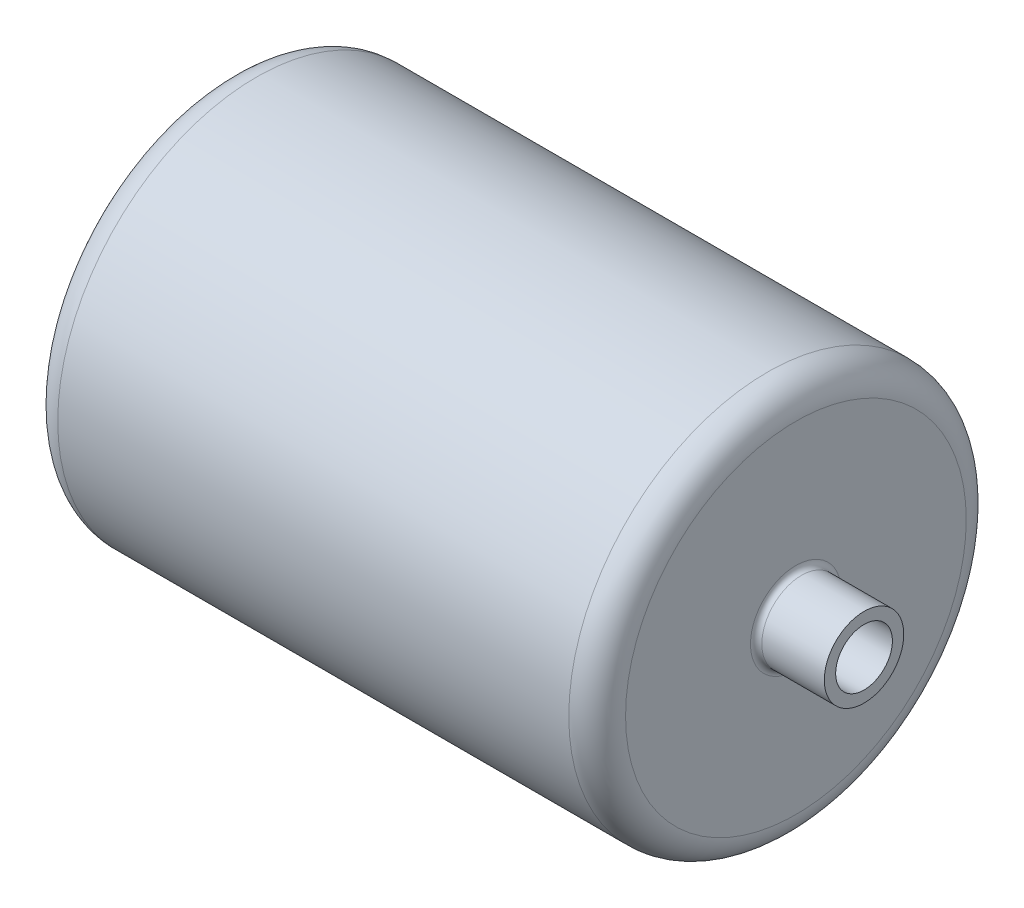
ISO-10303-21;
HEADER;
FILE_DESCRIPTION(('STEP AP214'),'2;1');
FILE_NAME('part.step','',(''),(''),'','','');
FILE_SCHEMA(('AUTOMOTIVE_DESIGN { 1 0 10303 214 1 1 1 1 }'));
ENDSEC;
DATA;
#1=APPLICATION_CONTEXT('core data for automotive mechanical design processes');
#2=APPLICATION_PROTOCOL_DEFINITION('international standard','automotive_design',2000,#1);
#3=PRODUCT_CONTEXT('',#1,'mechanical');
#4=PRODUCT('Part','Part','',(#3));
#5=PRODUCT_RELATED_PRODUCT_CATEGORY('part','',(#4));
#6=PRODUCT_DEFINITION_FORMATION('','',#4);
#7=PRODUCT_DEFINITION_CONTEXT('part definition',#1,'design');
#8=PRODUCT_DEFINITION('design','',#6,#7);
#9=PRODUCT_DEFINITION_SHAPE('','',#8);
#10=(LENGTH_UNIT() NAMED_UNIT(*) SI_UNIT(.MILLI.,.METRE.));
#11=(NAMED_UNIT(*) PLANE_ANGLE_UNIT() SI_UNIT($,.RADIAN.));
#12=(NAMED_UNIT(*) SI_UNIT($,.STERADIAN.) SOLID_ANGLE_UNIT());
#13=UNCERTAINTY_MEASURE_WITH_UNIT(LENGTH_MEASURE(1.E-05),#10,'distance_accuracy_value','');
#14=(GEOMETRIC_REPRESENTATION_CONTEXT(3) GLOBAL_UNCERTAINTY_ASSIGNED_CONTEXT((#13)) GLOBAL_UNIT_ASSIGNED_CONTEXT((#10,
#11,#12)) REPRESENTATION_CONTEXT('',''));
#15=CARTESIAN_POINT('',(0.,0.,0.));
#16=DIRECTION('',(0.,0.,1.));
#17=DIRECTION('',(1.,0.,0.));
#18=AXIS2_PLACEMENT_3D('',#15,#16,#17);
#19=CARTESIAN_POINT('',(-250.,150.,0.));
#20=DIRECTION('',(1.,0.,0.));
#21=DIRECTION('',(0.,0.,-1.));
#22=AXIS2_PLACEMENT_3D('',#19,#20,#21);
#23=PLANE('',#22);
#24=CARTESIAN_POINT('',(-250.,0.,0.));
#25=DIRECTION('',(-1.,0.,0.));
#26=DIRECTION('',(0.,0.,1.));
#27=AXIS2_PLACEMENT_3D('',#24,#25,#26);
#28=CIRCLE('',#27,150.);
#29=CARTESIAN_POINT('',(-250.,0.,150.));
#30=VERTEX_POINT('',#29);
#31=EDGE_CURVE('E41',#30,#30,#28,.T.);
#32=ORIENTED_EDGE('',*,*,#31,.T.);
#33=EDGE_LOOP('',(#32));
#34=FACE_BOUND('',#33,.T.);
#35=ADVANCED_FACE('F30',(#34),#23,.F.);
#36=CARTESIAN_POINT('',(-225.,0.,0.));
#37=DIRECTION('',(-1.,0.,0.));
#38=DIRECTION('',(0.,0.,1.));
#39=AXIS2_PLACEMENT_3D('',#36,#37,#38);
#40=TOROIDAL_SURFACE('',#39,150.,25.);
#41=ORIENTED_EDGE('',*,*,#31,.F.);
#42=EDGE_LOOP('',(#41));
#43=FACE_BOUND('',#42,.T.);
#44=CARTESIAN_POINT('',(-225.,0.,0.));
#45=DIRECTION('',(-1.,0.,0.));
#46=DIRECTION('',(0.,0.,1.));
#47=AXIS2_PLACEMENT_3D('',#44,#45,#46);
#48=CIRCLE('',#47,175.);
#49=CARTESIAN_POINT('',(-225.,0.,175.));
#50=VERTEX_POINT('',#49);
#51=EDGE_CURVE('E45',#50,#50,#48,.T.);
#52=ORIENTED_EDGE('',*,*,#51,.T.);
#53=EDGE_LOOP('',(#52));
#54=FACE_BOUND('',#53,.T.);
#55=ADVANCED_FACE('F92',(#43,#54),#40,.T.);
#56=CARTESIAN_POINT('',(-162.286662160442,0.,0.));
#57=DIRECTION('',(-1.,0.,0.));
#58=DIRECTION('',(0.,0.,1.));
#59=AXIS2_PLACEMENT_3D('',#56,#57,#58);
#60=CYLINDRICAL_SURFACE('',#59,175.);
#61=ORIENTED_EDGE('',*,*,#51,.F.);
#62=EDGE_LOOP('',(#61));
#63=FACE_BOUND('',#62,.T.);
#64=CARTESIAN_POINT('',(225.,0.,0.));
#65=DIRECTION('',(-1.,0.,0.));
#66=DIRECTION('',(0.,0.,1.));
#67=AXIS2_PLACEMENT_3D('',#64,#65,#66);
#68=CIRCLE('',#67,175.);
#69=CARTESIAN_POINT('',(225.,0.,175.));
#70=VERTEX_POINT('',#69);
#71=EDGE_CURVE('E50',#70,#70,#68,.T.);
#72=ORIENTED_EDGE('',*,*,#71,.T.);
#73=EDGE_LOOP('',(#72));
#74=FACE_BOUND('',#73,.T.);
#75=ADVANCED_FACE('F97',(#63,#74),#60,.T.);
#76=CARTESIAN_POINT('',(225.,0.,0.));
#77=DIRECTION('',(-1.,0.,0.));
#78=DIRECTION('',(0.,0.,1.));
#79=AXIS2_PLACEMENT_3D('',#76,#77,#78);
#80=TOROIDAL_SURFACE('',#79,150.,25.);
#81=ORIENTED_EDGE('',*,*,#71,.F.);
#82=EDGE_LOOP('',(#81));
#83=FACE_BOUND('',#82,.T.);
#84=CARTESIAN_POINT('',(250.,0.,0.));
#85=DIRECTION('',(-1.,0.,0.));
#86=DIRECTION('',(0.,0.,1.));
#87=AXIS2_PLACEMENT_3D('',#84,#85,#86);
#88=CIRCLE('',#87,150.);
#89=CARTESIAN_POINT('',(250.,0.,150.));
#90=VERTEX_POINT('',#89);
#91=EDGE_CURVE('E53',#90,#90,#88,.T.);
#92=ORIENTED_EDGE('',*,*,#91,.T.);
#93=EDGE_LOOP('',(#92));
#94=FACE_BOUND('',#93,.T.);
#95=ADVANCED_FACE('F103',(#83,#94),#80,.T.);
#96=CARTESIAN_POINT('',(250.,35.,0.));
#97=DIRECTION('',(-1.,0.,0.));
#98=DIRECTION('',(0.,0.,1.));
#99=AXIS2_PLACEMENT_3D('',#96,#97,#98);
#100=PLANE('',#99);
#101=CARTESIAN_POINT('',(250.,0.,0.));
#102=DIRECTION('',(-1.,0.,0.));
#103=DIRECTION('',(0.,0.,1.));
#104=AXIS2_PLACEMENT_3D('',#101,#102,#103);
#105=CIRCLE('',#104,40.);
#106=CARTESIAN_POINT('',(250.,0.,40.));
#107=VERTEX_POINT('',#106);
#108=EDGE_CURVE('E37',#107,#107,#105,.T.);
#109=ORIENTED_EDGE('',*,*,#108,.T.);
#110=EDGE_LOOP('',(#109));
#111=FACE_BOUND('',#110,.T.);
#112=ORIENTED_EDGE('',*,*,#91,.F.);
#113=EDGE_LOOP('',(#112));
#114=FACE_BOUND('',#113,.T.);
#115=ADVANCED_FACE('F107',(#111,#114),#100,.F.);
#116=CARTESIAN_POINT('',(-162.286662160442,0.,0.));
#117=DIRECTION('',(-1.,0.,0.));
#118=DIRECTION('',(0.,0.,1.));
#119=AXIS2_PLACEMENT_3D('',#116,#117,#118);
#120=CYLINDRICAL_SURFACE('',#119,35.);
#121=CARTESIAN_POINT('',(255.,0.,0.));
#122=DIRECTION('',(-1.,0.,0.));
#123=DIRECTION('',(0.,0.,1.));
#124=AXIS2_PLACEMENT_3D('',#121,#122,#123);
#125=CIRCLE('',#124,35.);
#126=CARTESIAN_POINT('',(255.,0.,35.));
#127=VERTEX_POINT('',#126);
#128=EDGE_CURVE('E10',#127,#127,#125,.F.);
#129=ORIENTED_EDGE('',*,*,#128,.T.);
#130=EDGE_LOOP('',(#129));
#131=FACE_BOUND('',#130,.T.);
#132=CARTESIAN_POINT('',(310.,0.,0.));
#133=DIRECTION('',(-1.,0.,0.));
#134=DIRECTION('',(0.,0.,1.));
#135=AXIS2_PLACEMENT_3D('',#132,#133,#134);
#136=CIRCLE('',#135,35.);
#137=CARTESIAN_POINT('',(310.,0.,35.));
#138=VERTEX_POINT('',#137);
#139=EDGE_CURVE('E56',#138,#138,#136,.T.);
#140=ORIENTED_EDGE('',*,*,#139,.T.);
#141=EDGE_LOOP('',(#140));
#142=FACE_BOUND('',#141,.T.);
#143=ADVANCED_FACE('F111',(#131,#142),#120,.T.);
#144=CARTESIAN_POINT('',(310.,25.,0.));
#145=DIRECTION('',(-1.,0.,0.));
#146=DIRECTION('',(0.,0.,1.));
#147=AXIS2_PLACEMENT_3D('',#144,#145,#146);
#148=PLANE('',#147);
#149=ORIENTED_EDGE('',*,*,#139,.F.);
#150=EDGE_LOOP('',(#149));
#151=FACE_BOUND('',#150,.T.);
#152=CARTESIAN_POINT('',(310.,0.,0.));
#153=DIRECTION('',(-1.,0.,0.));
#154=DIRECTION('',(0.,0.,1.));
#155=AXIS2_PLACEMENT_3D('',#152,#153,#154);
#156=CIRCLE('',#155,25.);
#157=CARTESIAN_POINT('',(310.,0.,25.));
#158=VERTEX_POINT('',#157);
#159=EDGE_CURVE('E59',#158,#158,#156,.T.);
#160=ORIENTED_EDGE('',*,*,#159,.T.);
#161=EDGE_LOOP('',(#160));
#162=FACE_BOUND('',#161,.T.);
#163=ADVANCED_FACE('F114',(#151,#162),#148,.F.);
#164=CARTESIAN_POINT('',(-162.286662160442,0.,0.));
#165=DIRECTION('',(-1.,0.,0.));
#166=DIRECTION('',(0.,0.,1.));
#167=AXIS2_PLACEMENT_3D('',#164,#165,#166);
#168=CYLINDRICAL_SURFACE('',#167,25.);
#169=ORIENTED_EDGE('',*,*,#159,.F.);
#170=EDGE_LOOP('',(#169));
#171=FACE_BOUND('',#170,.T.);
#172=CARTESIAN_POINT('',(225.,0.,0.));
#173=DIRECTION('',(-1.,0.,0.));
#174=DIRECTION('',(0.,0.,1.));
#175=AXIS2_PLACEMENT_3D('',#172,#173,#174);
#176=CIRCLE('',#175,25.);
#177=CARTESIAN_POINT('',(225.,0.,25.));
#178=VERTEX_POINT('',#177);
#179=EDGE_CURVE('E62',#178,#178,#176,.T.);
#180=ORIENTED_EDGE('',*,*,#179,.T.);
#181=EDGE_LOOP('',(#180));
#182=FACE_BOUND('',#181,.T.);
#183=ADVANCED_FACE('F117',(#171,#182),#168,.F.);
#184=CARTESIAN_POINT('',(225.,137.5,0.));
#185=DIRECTION('',(1.,0.,0.));
#186=DIRECTION('',(0.,0.,-1.));
#187=AXIS2_PLACEMENT_3D('',#184,#185,#186);
#188=PLANE('',#187);
#189=ORIENTED_EDGE('',*,*,#179,.F.);
#190=EDGE_LOOP('',(#189));
#191=FACE_BOUND('',#190,.T.);
#192=CARTESIAN_POINT('',(225.,0.,0.));
#193=DIRECTION('',(-1.,0.,0.));
#194=DIRECTION('',(0.,0.,1.));
#195=AXIS2_PLACEMENT_3D('',#192,#193,#194);
#196=CIRCLE('',#195,137.5);
#197=CARTESIAN_POINT('',(225.,0.,137.5));
#198=VERTEX_POINT('',#197);
#199=EDGE_CURVE('E65',#198,#198,#196,.T.);
#200=ORIENTED_EDGE('',*,*,#199,.T.);
#201=EDGE_LOOP('',(#200));
#202=FACE_BOUND('',#201,.T.);
#203=ADVANCED_FACE('F121',(#191,#202),#188,.F.);
#204=CARTESIAN_POINT('',(212.5,0.,0.));
#205=DIRECTION('',(-1.,0.,0.));
#206=DIRECTION('',(0.,0.,1.));
#207=AXIS2_PLACEMENT_3D('',#204,#205,#206);
#208=TOROIDAL_SURFACE('',#207,137.5,12.5);
#209=ORIENTED_EDGE('',*,*,#199,.F.);
#210=EDGE_LOOP('',(#209));
#211=FACE_BOUND('',#210,.T.);
#212=CARTESIAN_POINT('',(212.5,0.,0.));
#213=DIRECTION('',(-1.,0.,0.));
#214=DIRECTION('',(0.,0.,1.));
#215=AXIS2_PLACEMENT_3D('',#212,#213,#214);
#216=CIRCLE('',#215,150.);
#217=CARTESIAN_POINT('',(212.5,0.,150.));
#218=VERTEX_POINT('',#217);
#219=EDGE_CURVE('E68',#218,#218,#216,.T.);
#220=ORIENTED_EDGE('',*,*,#219,.T.);
#221=EDGE_LOOP('',(#220));
#222=FACE_BOUND('',#221,.T.);
#223=ADVANCED_FACE('F125',(#211,#222),#208,.F.);
#224=CARTESIAN_POINT('',(-162.286662160442,0.,0.));
#225=DIRECTION('',(-1.,0.,0.));
#226=DIRECTION('',(0.,0.,1.));
#227=AXIS2_PLACEMENT_3D('',#224,#225,#226);
#228=CYLINDRICAL_SURFACE('',#227,150.);
#229=ORIENTED_EDGE('',*,*,#219,.F.);
#230=EDGE_LOOP('',(#229));
#231=FACE_BOUND('',#230,.T.);
#232=CARTESIAN_POINT('',(-212.5,0.,0.));
#233=DIRECTION('',(-1.,0.,0.));
#234=DIRECTION('',(0.,0.,1.));
#235=AXIS2_PLACEMENT_3D('',#232,#233,#234);
#236=CIRCLE('',#235,150.);
#237=CARTESIAN_POINT('',(-212.5,0.,150.));
#238=VERTEX_POINT('',#237);
#239=EDGE_CURVE('E71',#238,#238,#236,.T.);
#240=ORIENTED_EDGE('',*,*,#239,.T.);
#241=EDGE_LOOP('',(#240));
#242=FACE_BOUND('',#241,.T.);
#243=ADVANCED_FACE('F88',(#231,#242),#228,.F.);
#244=CARTESIAN_POINT('',(-212.5,0.,0.));
#245=DIRECTION('',(-1.,0.,0.));
#246=DIRECTION('',(0.,0.,1.));
#247=AXIS2_PLACEMENT_3D('',#244,#245,#246);
#248=TOROIDAL_SURFACE('',#247,137.5,12.5);
#249=ORIENTED_EDGE('',*,*,#239,.F.);
#250=EDGE_LOOP('',(#249));
#251=FACE_BOUND('',#250,.T.);
#252=CARTESIAN_POINT('',(-225.,0.,0.));
#253=DIRECTION('',(-1.,0.,0.));
#254=DIRECTION('',(0.,0.,1.));
#255=AXIS2_PLACEMENT_3D('',#252,#253,#254);
#256=CIRCLE('',#255,137.5);
#257=CARTESIAN_POINT('',(-225.,0.,137.5));
#258=VERTEX_POINT('',#257);
#259=EDGE_CURVE('E74',#258,#258,#256,.T.);
#260=ORIENTED_EDGE('',*,*,#259,.T.);
#261=EDGE_LOOP('',(#260));
#262=FACE_BOUND('',#261,.T.);
#263=ADVANCED_FACE('F78',(#251,#262),#248,.F.);
#264=CARTESIAN_POINT('',(-225.,0.,0.));
#265=DIRECTION('',(-1.,0.,0.));
#266=DIRECTION('',(0.,0.,1.));
#267=AXIS2_PLACEMENT_3D('',#264,#265,#266);
#268=PLANE('',#267);
#269=ORIENTED_EDGE('',*,*,#259,.F.);
#270=EDGE_LOOP('',(#269));
#271=FACE_BOUND('',#270,.T.);
#272=ADVANCED_FACE('F80',(#271),#268,.F.);
#273=CARTESIAN_POINT('',(255.,0.,0.));
#274=DIRECTION('',(-1.,0.,0.));
#275=DIRECTION('',(0.,0.,1.));
#276=AXIS2_PLACEMENT_3D('',#273,#274,#275);
#277=TOROIDAL_SURFACE('',#276,40.,5.);
#278=ORIENTED_EDGE('',*,*,#128,.F.);
#279=EDGE_LOOP('',(#278));
#280=FACE_BOUND('',#279,.T.);
#281=ORIENTED_EDGE('',*,*,#108,.F.);
#282=EDGE_LOOP('',(#281));
#283=FACE_BOUND('',#282,.T.);
#284=ADVANCED_FACE('F32',(#280,#283),#277,.F.);
#285=CLOSED_SHELL('',(#35,#55,#75,#95,#115,#143,#163,#183,#203,#223,#243,#263,#272,#284));
#286=MANIFOLD_SOLID_BREP('B2',#285);
#287=ADVANCED_BREP_SHAPE_REPRESENTATION('',(#18,#286),#14);
#288=SHAPE_DEFINITION_REPRESENTATION(#9,#287);
ENDSEC;
END-ISO-10303-21;
